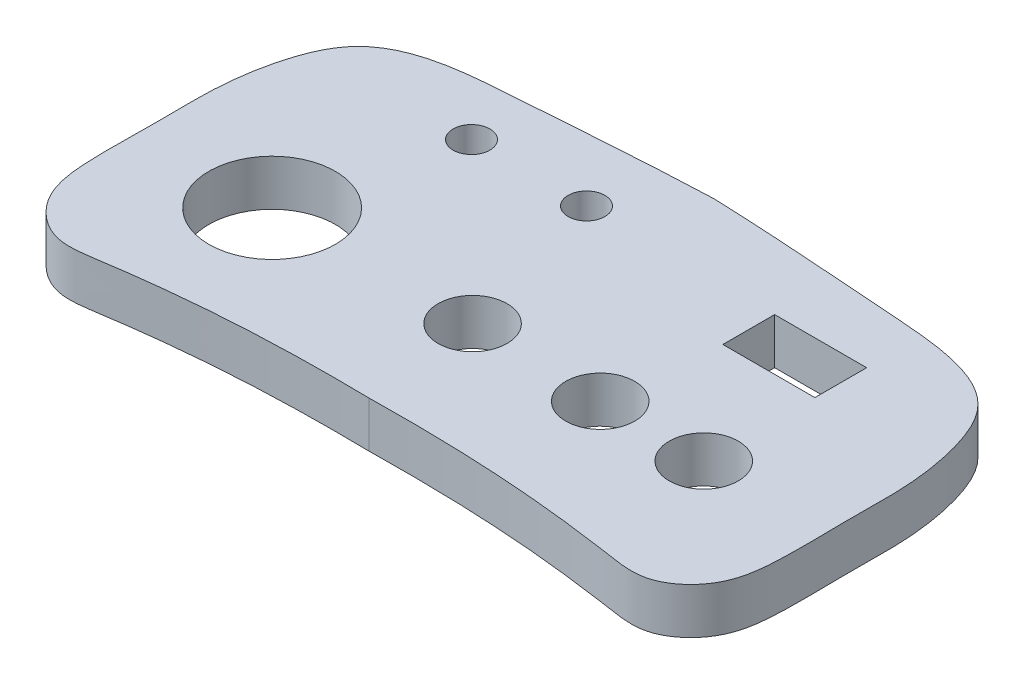
ISO-10303-21;
HEADER;
FILE_DESCRIPTION(('STEP AP214'),'2;1');
FILE_NAME('part.step','',(''),(''),'','','');
FILE_SCHEMA(('AUTOMOTIVE_DESIGN { 1 0 10303 214 1 1 1 1 }'));
ENDSEC;
DATA;
#1=APPLICATION_CONTEXT('core data for automotive mechanical design processes');
#2=APPLICATION_PROTOCOL_DEFINITION('international standard','automotive_design',2000,#1);
#3=PRODUCT_CONTEXT('',#1,'mechanical');
#4=PRODUCT('Part','Part','',(#3));
#5=PRODUCT_RELATED_PRODUCT_CATEGORY('part','',(#4));
#6=PRODUCT_DEFINITION_FORMATION('','',#4);
#7=PRODUCT_DEFINITION_CONTEXT('part definition',#1,'design');
#8=PRODUCT_DEFINITION('design','',#6,#7);
#9=PRODUCT_DEFINITION_SHAPE('','',#8);
#10=(LENGTH_UNIT() NAMED_UNIT(*) SI_UNIT(.MILLI.,.METRE.));
#11=(NAMED_UNIT(*) PLANE_ANGLE_UNIT() SI_UNIT($,.RADIAN.));
#12=(NAMED_UNIT(*) SI_UNIT($,.STERADIAN.) SOLID_ANGLE_UNIT());
#13=UNCERTAINTY_MEASURE_WITH_UNIT(LENGTH_MEASURE(1.E-05),#10,'distance_accuracy_value','');
#14=(GEOMETRIC_REPRESENTATION_CONTEXT(3) GLOBAL_UNCERTAINTY_ASSIGNED_CONTEXT((#13)) GLOBAL_UNIT_ASSIGNED_CONTEXT((#10,
#11,#12)) REPRESENTATION_CONTEXT('',''));
#15=CARTESIAN_POINT('',(0.,0.,0.));
#16=DIRECTION('',(0.,0.,1.));
#17=DIRECTION('',(1.,0.,0.));
#18=AXIS2_PLACEMENT_3D('',#15,#16,#17);
#19=CARTESIAN_POINT('',(0.,4.,12.0711586915417));
#20=CARTESIAN_POINT('',(7.80722657595746,4.,11.9388791018897));
#21=CARTESIAN_POINT('',(15.7201314042807,4.,12.3493127279278));
#22=CARTESIAN_POINT('',(26.0311745833425,4.,14.0817505540502));
#23=CARTESIAN_POINT('',(29.6371828286956,4.,10.9287665933557));
#24=CARTESIAN_POINT('',(30.1549278508663,4.,5.70169142307951));
#25=CARTESIAN_POINT('',(29.9406933071393,4.,0.887353995512586));
#26=CARTESIAN_POINT('',(30.0904697170656,4.,-4.33609871158164));
#27=CARTESIAN_POINT('',(29.550286899474,4.,-8.92925037055667));
#28=CARTESIAN_POINT('',(26.8757166498351,4.,-16.1960144953641));
#29=CARTESIAN_POINT('',(13.9033574872135,4.,-17.0425876368378));
#30=CARTESIAN_POINT('',(5.82021209508084,4.,-17.7095362441117));
#31=CARTESIAN_POINT('',(0.,4.,-17.9288413084583));
#32=B_SPLINE_CURVE_WITH_KNOTS('',3,(#19,#20,#21,#22,#23,#24,#25,#26,#27,#28,#29,#30,#31),
.UNSPECIFIED.,.F.,.F.,(4,1,1,1,1,1,1,1,1,1,4),(0.,0.268119341177124,0.309991094049163,
0.3640671280651,0.4172491624366,0.494623043419222,0.540270268501581,0.605523361226878,
0.663987204348086,0.801540498685919,1.),.UNSPECIFIED.);
#33=DIRECTION('',(0.,-1.,0.));
#34=VECTOR('',#33,1.);
#35=SURFACE_OF_LINEAR_EXTRUSION('',#32,#34);
#36=CARTESIAN_POINT('',(0.,0.,12.0711586915417));
#37=CARTESIAN_POINT('',(7.80722657595746,0.,11.9388791018897));
#38=CARTESIAN_POINT('',(15.7201314042807,0.,12.3493127279278));
#39=CARTESIAN_POINT('',(26.0311745833425,0.,14.0817505540502));
#40=CARTESIAN_POINT('',(29.6371828286956,0.,10.9287665933557));
#41=CARTESIAN_POINT('',(30.1549278508663,0.,5.70169142307951));
#42=CARTESIAN_POINT('',(29.9406933071393,0.,0.887353995512586));
#43=CARTESIAN_POINT('',(30.0904697170656,0.,-4.33609871158164));
#44=CARTESIAN_POINT('',(29.550286899474,0.,-8.92925037055667));
#45=CARTESIAN_POINT('',(26.8757166498351,0.,-16.1960144953641));
#46=CARTESIAN_POINT('',(13.9033574872135,0.,-17.0425876368378));
#47=CARTESIAN_POINT('',(5.82021209508084,0.,-17.7095362441117));
#48=CARTESIAN_POINT('',(0.,0.,-17.9288413084583));
#49=B_SPLINE_CURVE_WITH_KNOTS('',3,(#36,#37,#38,#39,#40,#41,#42,#43,#44,#45,#46,#47,#48),
.UNSPECIFIED.,.F.,.F.,(4,1,1,1,1,1,1,1,1,1,4),(0.,0.268119341177124,0.309991094049163,
0.3640671280651,0.4172491624366,0.494623043419222,0.540270268501581,0.605523361226878,
0.663987204348086,0.801540498685919,1.),.UNSPECIFIED.);
#50=CARTESIAN_POINT('',(0.,0.,12.0711586915417));
#51=VERTEX_POINT('',#50);
#52=CARTESIAN_POINT('',(0.,0.,-17.9288413084583));
#53=VERTEX_POINT('',#52);
#54=EDGE_CURVE('E154',#51,#53,#49,.T.);
#55=ORIENTED_EDGE('',*,*,#54,.T.);
#56=DIRECTION('',(0.,-1.,0.));
#57=VECTOR('',#56,1.);
#58=CARTESIAN_POINT('',(0.,4.,-17.9288413084583));
#59=LINE('',#58,#57);
#60=CARTESIAN_POINT('',(0.,4.,-17.9288413084583));
#61=VERTEX_POINT('',#60);
#62=EDGE_CURVE('E217',#61,#53,#59,.T.);
#63=ORIENTED_EDGE('',*,*,#62,.F.);
#64=CARTESIAN_POINT('',(0.,4.,12.0711586915417));
#65=VERTEX_POINT('',#64);
#66=EDGE_CURVE('E138',#65,#61,#32,.T.);
#67=ORIENTED_EDGE('',*,*,#66,.F.);
#68=DIRECTION('',(0.,-1.,0.));
#69=VECTOR('',#68,1.);
#70=CARTESIAN_POINT('',(0.,4.,12.0711586915417));
#71=LINE('',#70,#69);
#72=EDGE_CURVE('E153',#65,#51,#71,.T.);
#73=ORIENTED_EDGE('',*,*,#72,.T.);
#74=EDGE_LOOP('',(#55,#63,#67,#73));
#75=FACE_BOUND('',#74,.T.);
#76=ADVANCED_FACE('F34',(#75),#35,.F.);
#77=CARTESIAN_POINT('',(0.,4.,-17.9288413084583));
#78=CARTESIAN_POINT('',(-5.82021209508084,4.,-17.7095362441117));
#79=CARTESIAN_POINT('',(-13.9033574872135,4.,-17.0425876368378));
#80=CARTESIAN_POINT('',(-26.8757166498351,4.,-16.196014495364));
#81=CARTESIAN_POINT('',(-29.550286899474,4.,-8.92925037055667));
#82=CARTESIAN_POINT('',(-30.0904697170656,4.,-4.33609871158164));
#83=CARTESIAN_POINT('',(-29.9406933071393,4.,0.887353995512594));
#84=CARTESIAN_POINT('',(-30.1549278508663,4.,5.70169142307952));
#85=CARTESIAN_POINT('',(-29.6371828286956,4.,10.9287665933557));
#86=CARTESIAN_POINT('',(-26.0311745833425,4.,14.0817505540502));
#87=CARTESIAN_POINT('',(-15.7201314042807,4.,12.3493127279278));
#88=CARTESIAN_POINT('',(-7.80722657595746,4.,11.9388791018897));
#89=CARTESIAN_POINT('',(0.,4.,12.0711586915417));
#90=B_SPLINE_CURVE_WITH_KNOTS('',3,(#77,#78,#79,#80,#81,#82,#83,#84,#85,#86,#87,#88,#89),
.UNSPECIFIED.,.F.,.F.,(4,1,1,1,1,1,1,1,1,1,4),(0.,0.198459501314081,0.336012795651914,
0.394476638773122,0.459729731498419,0.505376956580778,0.5827508375634,0.6359328719349,
0.690008905950837,0.731880658822876,1.),.UNSPECIFIED.);
#91=DIRECTION('',(0.,-1.,0.));
#92=VECTOR('',#91,1.);
#93=SURFACE_OF_LINEAR_EXTRUSION('',#90,#92);
#94=CARTESIAN_POINT('',(0.,0.,-17.9288413084583));
#95=CARTESIAN_POINT('',(-5.82021209508084,0.,-17.7095362441117));
#96=CARTESIAN_POINT('',(-13.9033574872135,0.,-17.0425876368378));
#97=CARTESIAN_POINT('',(-26.8757166498351,0.,-16.196014495364));
#98=CARTESIAN_POINT('',(-29.550286899474,0.,-8.92925037055667));
#99=CARTESIAN_POINT('',(-30.0904697170656,0.,-4.33609871158164));
#100=CARTESIAN_POINT('',(-29.9406933071393,0.,0.887353995512594));
#101=CARTESIAN_POINT('',(-30.1549278508663,0.,5.70169142307952));
#102=CARTESIAN_POINT('',(-29.6371828286956,0.,10.9287665933557));
#103=CARTESIAN_POINT('',(-26.0311745833425,0.,14.0817505540502));
#104=CARTESIAN_POINT('',(-15.7201314042807,0.,12.3493127279278));
#105=CARTESIAN_POINT('',(-7.80722657595746,0.,11.9388791018897));
#106=CARTESIAN_POINT('',(0.,0.,12.0711586915417));
#107=B_SPLINE_CURVE_WITH_KNOTS('',3,(#94,#95,#96,#97,#98,#99,#100,#101,#102,#103,#104,#105,
#106),.UNSPECIFIED.,.F.,.F.,(4,1,1,1,1,1,1,1,1,1,4),(0.,0.198459501314081,0.336012795651914,
0.394476638773122,0.459729731498419,0.505376956580778,0.5827508375634,0.6359328719349,
0.690008905950837,0.731880658822876,1.),.UNSPECIFIED.);
#108=EDGE_CURVE('E145',#53,#51,#107,.T.);
#109=ORIENTED_EDGE('',*,*,#108,.T.);
#110=ORIENTED_EDGE('',*,*,#72,.F.);
#111=EDGE_CURVE('E144',#61,#65,#90,.T.);
#112=ORIENTED_EDGE('',*,*,#111,.F.);
#113=ORIENTED_EDGE('',*,*,#62,.T.);
#114=EDGE_LOOP('',(#109,#110,#112,#113));
#115=FACE_BOUND('',#114,.T.);
#116=ADVANCED_FACE('F161',(#115),#93,.F.);
#117=CARTESIAN_POINT('',(30.0020337285879,4.,-0.445277639874697));
#118=DIRECTION('',(0.,1.,0.));
#119=DIRECTION('',(0.,0.,1.));
#120=AXIS2_PLACEMENT_3D('',#117,#118,#119);
#121=PLANE('',#120);
#122=DIRECTION('',(0.,0.,1.));
#123=VECTOR('',#122,1.);
#124=CARTESIAN_POINT('',(11.3495328003227,4.,-11.8420260404832));
#125=LINE('',#124,#123);
#126=CARTESIAN_POINT('',(11.3495328003227,4.,-11.8420260404832));
#127=VERTEX_POINT('',#126);
#128=CARTESIAN_POINT('',(11.3495328003227,4.,-7.34202604048323));
#129=VERTEX_POINT('',#128);
#130=EDGE_CURVE('E49',#127,#129,#125,.T.);
#131=ORIENTED_EDGE('',*,*,#130,.F.);
#132=DIRECTION('',(-1.,0.,0.));
#133=VECTOR('',#132,1.);
#134=CARTESIAN_POINT('',(11.3495328003227,4.,-11.8420260404832));
#135=LINE('',#134,#133);
#136=CARTESIAN_POINT('',(19.3495328003227,4.,-11.8420260404832));
#137=VERTEX_POINT('',#136);
#138=EDGE_CURVE('E106',#137,#127,#135,.T.);
#139=ORIENTED_EDGE('',*,*,#138,.F.);
#140=DIRECTION('',(0.,0.,-1.));
#141=VECTOR('',#140,1.);
#142=CARTESIAN_POINT('',(19.3495328003227,4.,-11.8420260404832));
#143=LINE('',#142,#141);
#144=CARTESIAN_POINT('',(19.3495328003227,4.,-7.34202604048323));
#145=VERTEX_POINT('',#144);
#146=EDGE_CURVE('E90',#145,#137,#143,.T.);
#147=ORIENTED_EDGE('',*,*,#146,.F.);
#148=DIRECTION('',(1.,0.,0.));
#149=VECTOR('',#148,1.);
#150=CARTESIAN_POINT('',(11.3495328003227,4.,-7.34202604048323));
#151=LINE('',#150,#149);
#152=EDGE_CURVE('E99',#129,#145,#151,.T.);
#153=ORIENTED_EDGE('',*,*,#152,.F.);
#154=EDGE_LOOP('',(#131,#139,#147,#153));
#155=FACE_BOUND('',#154,.T.);
#156=CARTESIAN_POINT('',(-5.00203372858789,4.,-11.8420260404832));
#157=DIRECTION('',(0.,1.,0.));
#158=DIRECTION('',(0.,0.,1.));
#159=AXIS2_PLACEMENT_3D('',#156,#157,#158);
#160=CIRCLE('',#159,1.6);
#161=CARTESIAN_POINT('',(-5.00203372858789,4.,-10.2420260404832));
#162=VERTEX_POINT('',#161);
#163=EDGE_CURVE('E113',#162,#162,#160,.T.);
#164=ORIENTED_EDGE('',*,*,#163,.F.);
#165=EDGE_LOOP('',(#164));
#166=FACE_BOUND('',#165,.T.);
#167=CARTESIAN_POINT('',(-15.0020337285879,4.,-11.8420260404832));
#168=DIRECTION('',(0.,1.,0.));
#169=DIRECTION('',(0.,0.,1.));
#170=AXIS2_PLACEMENT_3D('',#167,#168,#169);
#171=CIRCLE('',#170,1.6);
#172=CARTESIAN_POINT('',(-15.0020337285879,4.,-10.2420260404832));
#173=VERTEX_POINT('',#172);
#174=EDGE_CURVE('E119',#173,#173,#171,.T.);
#175=ORIENTED_EDGE('',*,*,#174,.F.);
#176=EDGE_LOOP('',(#175));
#177=FACE_BOUND('',#176,.T.);
#178=CARTESIAN_POINT('',(19.2934625468833,4.,2.2619639755419));
#179=DIRECTION('',(0.,1.,0.));
#180=DIRECTION('',(0.,0.,1.));
#181=AXIS2_PLACEMENT_3D('',#178,#179,#180);
#182=CIRCLE('',#181,3.);
#183=CARTESIAN_POINT('',(19.2934625468833,4.,5.2619639755419));
#184=VERTEX_POINT('',#183);
#185=EDGE_CURVE('E123',#184,#184,#182,.T.);
#186=ORIENTED_EDGE('',*,*,#185,.F.);
#187=EDGE_LOOP('',(#186));
#188=FACE_BOUND('',#187,.T.);
#189=CARTESIAN_POINT('',(10.2934625468833,4.,2.2619639755419));
#190=DIRECTION('',(0.,1.,0.));
#191=DIRECTION('',(0.,0.,1.));
#192=AXIS2_PLACEMENT_3D('',#189,#190,#191);
#193=CIRCLE('',#192,3.);
#194=CARTESIAN_POINT('',(10.2934625468833,4.,5.2619639755419));
#195=VERTEX_POINT('',#194);
#196=EDGE_CURVE('E127',#195,#195,#193,.T.);
#197=ORIENTED_EDGE('',*,*,#196,.F.);
#198=EDGE_LOOP('',(#197));
#199=FACE_BOUND('',#198,.T.);
#200=CARTESIAN_POINT('',(-1.10226697159987,4.,1.96249938132098));
#201=DIRECTION('',(0.,1.,0.));
#202=DIRECTION('',(0.,0.,1.));
#203=AXIS2_PLACEMENT_3D('',#200,#201,#202);
#204=CIRCLE('',#203,3.);
#205=CARTESIAN_POINT('',(-1.10226697159987,4.,4.96249938132098));
#206=VERTEX_POINT('',#205);
#207=EDGE_CURVE('E131',#206,#206,#204,.T.);
#208=ORIENTED_EDGE('',*,*,#207,.F.);
#209=EDGE_LOOP('',(#208));
#210=FACE_BOUND('',#209,.T.);
#211=CARTESIAN_POINT('',(-18.5277481666049,4.,1.96249938132098));
#212=DIRECTION('',(0.,1.,0.));
#213=DIRECTION('',(0.,0.,1.));
#214=AXIS2_PLACEMENT_3D('',#211,#212,#213);
#215=CIRCLE('',#214,5.5);
#216=CARTESIAN_POINT('',(-18.5277481666049,4.,7.46249938132098));
#217=VERTEX_POINT('',#216);
#218=EDGE_CURVE('E135',#217,#217,#215,.T.);
#219=ORIENTED_EDGE('',*,*,#218,.F.);
#220=EDGE_LOOP('',(#219));
#221=FACE_BOUND('',#220,.T.);
#222=ORIENTED_EDGE('',*,*,#66,.T.);
#223=ORIENTED_EDGE('',*,*,#111,.T.);
#224=EDGE_LOOP('',(#222,#223));
#225=FACE_BOUND('',#224,.T.);
#226=ADVANCED_FACE('F103',(#155,#166,#177,#188,#199,#210,#221,#225),#121,.T.);
#227=CARTESIAN_POINT('',(30.0020337285879,0.,-0.445277639874697));
#228=DIRECTION('',(0.,1.,0.));
#229=DIRECTION('',(0.,0.,1.));
#230=AXIS2_PLACEMENT_3D('',#227,#228,#229);
#231=PLANE('',#230);
#232=DIRECTION('',(-1.,0.,0.));
#233=VECTOR('',#232,1.);
#234=CARTESIAN_POINT('',(30.0020337285879,0.,-11.8420260404832));
#235=LINE('',#234,#233);
#236=CARTESIAN_POINT('',(19.3495328003227,0.,-11.8420260404832));
#237=VERTEX_POINT('',#236);
#238=CARTESIAN_POINT('',(11.3495328003227,0.,-11.8420260404832));
#239=VERTEX_POINT('',#238);
#240=EDGE_CURVE('E42',#237,#239,#235,.T.);
#241=ORIENTED_EDGE('',*,*,#240,.T.);
#242=DIRECTION('',(0.,0.,1.));
#243=VECTOR('',#242,1.);
#244=CARTESIAN_POINT('',(11.3495328003227,0.,-0.445277639874697));
#245=LINE('',#244,#243);
#246=CARTESIAN_POINT('',(11.3495328003227,0.,-7.34202604048323));
#247=VERTEX_POINT('',#246);
#248=EDGE_CURVE('E11',#239,#247,#245,.T.);
#249=ORIENTED_EDGE('',*,*,#248,.T.);
#250=DIRECTION('',(1.,0.,0.));
#251=VECTOR('',#250,1.);
#252=CARTESIAN_POINT('',(30.0020337285879,0.,-7.34202604048323));
#253=LINE('',#252,#251);
#254=CARTESIAN_POINT('',(19.3495328003227,0.,-7.34202604048323));
#255=VERTEX_POINT('',#254);
#256=EDGE_CURVE('E237',#247,#255,#253,.T.);
#257=ORIENTED_EDGE('',*,*,#256,.T.);
#258=DIRECTION('',(0.,0.,-1.));
#259=VECTOR('',#258,1.);
#260=CARTESIAN_POINT('',(19.3495328003227,0.,-0.445277639874697));
#261=LINE('',#260,#259);
#262=EDGE_CURVE('E93',#255,#237,#261,.T.);
#263=ORIENTED_EDGE('',*,*,#262,.T.);
#264=EDGE_LOOP('',(#241,#249,#257,#263));
#265=FACE_BOUND('',#264,.T.);
#266=CARTESIAN_POINT('',(-5.00203372858789,0.,-11.8420260404832));
#267=DIRECTION('',(0.,1.,0.));
#268=DIRECTION('',(0.,0.,1.));
#269=AXIS2_PLACEMENT_3D('',#266,#267,#268);
#270=CIRCLE('',#269,1.6);
#271=CARTESIAN_POINT('',(-5.00203372858789,0.,-10.2420260404832));
#272=VERTEX_POINT('',#271);
#273=EDGE_CURVE('E118',#272,#272,#270,.T.);
#274=ORIENTED_EDGE('',*,*,#273,.T.);
#275=EDGE_LOOP('',(#274));
#276=FACE_BOUND('',#275,.T.);
#277=CARTESIAN_POINT('',(-15.0020337285879,0.,-11.8420260404832));
#278=DIRECTION('',(0.,1.,0.));
#279=DIRECTION('',(0.,0.,1.));
#280=AXIS2_PLACEMENT_3D('',#277,#278,#279);
#281=CIRCLE('',#280,1.6);
#282=CARTESIAN_POINT('',(-15.0020337285879,0.,-10.2420260404832));
#283=VERTEX_POINT('',#282);
#284=EDGE_CURVE('E122',#283,#283,#281,.T.);
#285=ORIENTED_EDGE('',*,*,#284,.T.);
#286=EDGE_LOOP('',(#285));
#287=FACE_BOUND('',#286,.T.);
#288=CARTESIAN_POINT('',(19.2934625468833,0.,2.2619639755419));
#289=DIRECTION('',(0.,1.,0.));
#290=DIRECTION('',(0.,0.,1.));
#291=AXIS2_PLACEMENT_3D('',#288,#289,#290);
#292=CIRCLE('',#291,3.);
#293=CARTESIAN_POINT('',(19.2934625468833,0.,5.2619639755419));
#294=VERTEX_POINT('',#293);
#295=EDGE_CURVE('E126',#294,#294,#292,.T.);
#296=ORIENTED_EDGE('',*,*,#295,.T.);
#297=EDGE_LOOP('',(#296));
#298=FACE_BOUND('',#297,.T.);
#299=CARTESIAN_POINT('',(10.2934625468833,0.,2.2619639755419));
#300=DIRECTION('',(0.,1.,0.));
#301=DIRECTION('',(0.,0.,1.));
#302=AXIS2_PLACEMENT_3D('',#299,#300,#301);
#303=CIRCLE('',#302,3.);
#304=CARTESIAN_POINT('',(10.2934625468833,0.,5.2619639755419));
#305=VERTEX_POINT('',#304);
#306=EDGE_CURVE('E130',#305,#305,#303,.T.);
#307=ORIENTED_EDGE('',*,*,#306,.T.);
#308=EDGE_LOOP('',(#307));
#309=FACE_BOUND('',#308,.T.);
#310=CARTESIAN_POINT('',(-1.10226697159987,0.,1.96249938132098));
#311=DIRECTION('',(0.,1.,0.));
#312=DIRECTION('',(0.,0.,1.));
#313=AXIS2_PLACEMENT_3D('',#310,#311,#312);
#314=CIRCLE('',#313,3.);
#315=CARTESIAN_POINT('',(-1.10226697159987,0.,4.96249938132098));
#316=VERTEX_POINT('',#315);
#317=EDGE_CURVE('E134',#316,#316,#314,.T.);
#318=ORIENTED_EDGE('',*,*,#317,.T.);
#319=EDGE_LOOP('',(#318));
#320=FACE_BOUND('',#319,.T.);
#321=CARTESIAN_POINT('',(-18.5277481666049,0.,1.96249938132098));
#322=DIRECTION('',(0.,1.,0.));
#323=DIRECTION('',(0.,0.,1.));
#324=AXIS2_PLACEMENT_3D('',#321,#322,#323);
#325=CIRCLE('',#324,5.5);
#326=CARTESIAN_POINT('',(-18.5277481666049,0.,7.46249938132098));
#327=VERTEX_POINT('',#326);
#328=EDGE_CURVE('E137',#327,#327,#325,.T.);
#329=ORIENTED_EDGE('',*,*,#328,.T.);
#330=EDGE_LOOP('',(#329));
#331=FACE_BOUND('',#330,.T.);
#332=ORIENTED_EDGE('',*,*,#54,.F.);
#333=ORIENTED_EDGE('',*,*,#108,.F.);
#334=EDGE_LOOP('',(#332,#333));
#335=FACE_BOUND('',#334,.T.);
#336=ADVANCED_FACE('F165',(#265,#276,#287,#298,#309,#320,#331,#335),#231,.F.);
#337=CARTESIAN_POINT('',(-18.5277481666049,-6.,1.96249938132098));
#338=DIRECTION('',(0.,1.,0.));
#339=DIRECTION('',(0.,0.,1.));
#340=AXIS2_PLACEMENT_3D('',#337,#338,#339);
#341=CYLINDRICAL_SURFACE('',#340,5.5);
#342=ORIENTED_EDGE('',*,*,#218,.T.);
#343=EDGE_LOOP('',(#342));
#344=FACE_BOUND('',#343,.T.);
#345=ORIENTED_EDGE('',*,*,#328,.F.);
#346=EDGE_LOOP('',(#345));
#347=FACE_BOUND('',#346,.T.);
#348=ADVANCED_FACE('F168',(#344,#347),#341,.F.);
#349=CARTESIAN_POINT('',(-1.10226697159987,-6.,1.96249938132098));
#350=DIRECTION('',(0.,1.,0.));
#351=DIRECTION('',(0.,0.,1.));
#352=AXIS2_PLACEMENT_3D('',#349,#350,#351);
#353=CYLINDRICAL_SURFACE('',#352,3.);
#354=ORIENTED_EDGE('',*,*,#207,.T.);
#355=EDGE_LOOP('',(#354));
#356=FACE_BOUND('',#355,.T.);
#357=ORIENTED_EDGE('',*,*,#317,.F.);
#358=EDGE_LOOP('',(#357));
#359=FACE_BOUND('',#358,.T.);
#360=ADVANCED_FACE('F174',(#356,#359),#353,.F.);
#361=CARTESIAN_POINT('',(10.2934625468833,-6.,2.2619639755419));
#362=DIRECTION('',(0.,1.,0.));
#363=DIRECTION('',(0.,0.,1.));
#364=AXIS2_PLACEMENT_3D('',#361,#362,#363);
#365=CYLINDRICAL_SURFACE('',#364,3.);
#366=ORIENTED_EDGE('',*,*,#196,.T.);
#367=EDGE_LOOP('',(#366));
#368=FACE_BOUND('',#367,.T.);
#369=ORIENTED_EDGE('',*,*,#306,.F.);
#370=EDGE_LOOP('',(#369));
#371=FACE_BOUND('',#370,.T.);
#372=ADVANCED_FACE('F178',(#368,#371),#365,.F.);
#373=CARTESIAN_POINT('',(19.2934625468833,-6.,2.2619639755419));
#374=DIRECTION('',(0.,1.,0.));
#375=DIRECTION('',(0.,0.,1.));
#376=AXIS2_PLACEMENT_3D('',#373,#374,#375);
#377=CYLINDRICAL_SURFACE('',#376,3.);
#378=ORIENTED_EDGE('',*,*,#185,.T.);
#379=EDGE_LOOP('',(#378));
#380=FACE_BOUND('',#379,.T.);
#381=ORIENTED_EDGE('',*,*,#295,.F.);
#382=EDGE_LOOP('',(#381));
#383=FACE_BOUND('',#382,.T.);
#384=ADVANCED_FACE('F182',(#380,#383),#377,.F.);
#385=CARTESIAN_POINT('',(-15.0020337285879,-6.,-11.8420260404832));
#386=DIRECTION('',(0.,1.,0.));
#387=DIRECTION('',(0.,0.,1.));
#388=AXIS2_PLACEMENT_3D('',#385,#386,#387);
#389=CYLINDRICAL_SURFACE('',#388,1.6);
#390=ORIENTED_EDGE('',*,*,#174,.T.);
#391=EDGE_LOOP('',(#390));
#392=FACE_BOUND('',#391,.T.);
#393=ORIENTED_EDGE('',*,*,#284,.F.);
#394=EDGE_LOOP('',(#393));
#395=FACE_BOUND('',#394,.T.);
#396=ADVANCED_FACE('F186',(#392,#395),#389,.F.);
#397=CARTESIAN_POINT('',(-5.00203372858789,-6.,-11.8420260404832));
#398=DIRECTION('',(0.,1.,0.));
#399=DIRECTION('',(0.,0.,1.));
#400=AXIS2_PLACEMENT_3D('',#397,#398,#399);
#401=CYLINDRICAL_SURFACE('',#400,1.6);
#402=ORIENTED_EDGE('',*,*,#163,.T.);
#403=EDGE_LOOP('',(#402));
#404=FACE_BOUND('',#403,.T.);
#405=ORIENTED_EDGE('',*,*,#273,.F.);
#406=EDGE_LOOP('',(#405));
#407=FACE_BOUND('',#406,.T.);
#408=ADVANCED_FACE('F190',(#404,#407),#401,.F.);
#409=CARTESIAN_POINT('',(11.3495328003227,-6.,-11.8420260404832));
#410=DIRECTION('',(-1.,0.,0.));
#411=DIRECTION('',(0.,0.,1.));
#412=AXIS2_PLACEMENT_3D('',#409,#410,#411);
#413=PLANE('',#412);
#414=DIRECTION('',(0.,1.,0.));
#415=VECTOR('',#414,1.);
#416=CARTESIAN_POINT('',(11.3495328003227,-6.,-11.8420260404832));
#417=LINE('',#416,#415);
#418=EDGE_CURVE('E111',#239,#127,#417,.T.);
#419=ORIENTED_EDGE('',*,*,#418,.T.);
#420=ORIENTED_EDGE('',*,*,#130,.T.);
#421=DIRECTION('',(0.,1.,0.));
#422=VECTOR('',#421,1.);
#423=CARTESIAN_POINT('',(11.3495328003227,-6.,-7.34202604048323));
#424=LINE('',#423,#422);
#425=EDGE_CURVE('E96',#247,#129,#424,.T.);
#426=ORIENTED_EDGE('',*,*,#425,.F.);
#427=ORIENTED_EDGE('',*,*,#248,.F.);
#428=EDGE_LOOP('',(#419,#420,#426,#427));
#429=FACE_BOUND('',#428,.T.);
#430=ADVANCED_FACE('F194',(#429),#413,.F.);
#431=CARTESIAN_POINT('',(11.3495328003227,-6.,-11.8420260404832));
#432=DIRECTION('',(0.,0.,-1.));
#433=DIRECTION('',(-1.,0.,0.));
#434=AXIS2_PLACEMENT_3D('',#431,#432,#433);
#435=PLANE('',#434);
#436=DIRECTION('',(0.,1.,0.));
#437=VECTOR('',#436,1.);
#438=CARTESIAN_POINT('',(19.3495328003227,-6.,-11.8420260404832));
#439=LINE('',#438,#437);
#440=EDGE_CURVE('E95',#237,#137,#439,.T.);
#441=ORIENTED_EDGE('',*,*,#440,.T.);
#442=ORIENTED_EDGE('',*,*,#138,.T.);
#443=ORIENTED_EDGE('',*,*,#418,.F.);
#444=ORIENTED_EDGE('',*,*,#240,.F.);
#445=EDGE_LOOP('',(#441,#442,#443,#444));
#446=FACE_BOUND('',#445,.T.);
#447=ADVANCED_FACE('F198',(#446),#435,.F.);
#448=CARTESIAN_POINT('',(19.3495328003227,-6.,-11.8420260404832));
#449=DIRECTION('',(1.,0.,0.));
#450=DIRECTION('',(0.,0.,-1.));
#451=AXIS2_PLACEMENT_3D('',#448,#449,#450);
#452=PLANE('',#451);
#453=DIRECTION('',(0.,1.,0.));
#454=VECTOR('',#453,1.);
#455=CARTESIAN_POINT('',(19.3495328003227,-6.,-7.34202604048323));
#456=LINE('',#455,#454);
#457=EDGE_CURVE('E57',#255,#145,#456,.T.);
#458=ORIENTED_EDGE('',*,*,#457,.T.);
#459=ORIENTED_EDGE('',*,*,#146,.T.);
#460=ORIENTED_EDGE('',*,*,#440,.F.);
#461=ORIENTED_EDGE('',*,*,#262,.F.);
#462=EDGE_LOOP('',(#458,#459,#460,#461));
#463=FACE_BOUND('',#462,.T.);
#464=ADVANCED_FACE('F87',(#463),#452,.F.);
#465=CARTESIAN_POINT('',(11.3495328003227,-6.,-7.34202604048323));
#466=DIRECTION('',(0.,0.,1.));
#467=DIRECTION('',(1.,0.,0.));
#468=AXIS2_PLACEMENT_3D('',#465,#466,#467);
#469=PLANE('',#468);
#470=ORIENTED_EDGE('',*,*,#425,.T.);
#471=ORIENTED_EDGE('',*,*,#152,.T.);
#472=ORIENTED_EDGE('',*,*,#457,.F.);
#473=ORIENTED_EDGE('',*,*,#256,.F.);
#474=EDGE_LOOP('',(#470,#471,#472,#473));
#475=FACE_BOUND('',#474,.T.);
#476=ADVANCED_FACE('F100',(#475),#469,.F.);
#477=CLOSED_SHELL('',(#76,#116,#226,#336,#348,#360,#372,#384,#396,#408,#430,#447,#464,#476));
#478=MANIFOLD_SOLID_BREP('B2',#477);
#479=ADVANCED_BREP_SHAPE_REPRESENTATION('',(#18,#478),#14);
#480=SHAPE_DEFINITION_REPRESENTATION(#9,#479);
ENDSEC;
END-ISO-10303-21;
